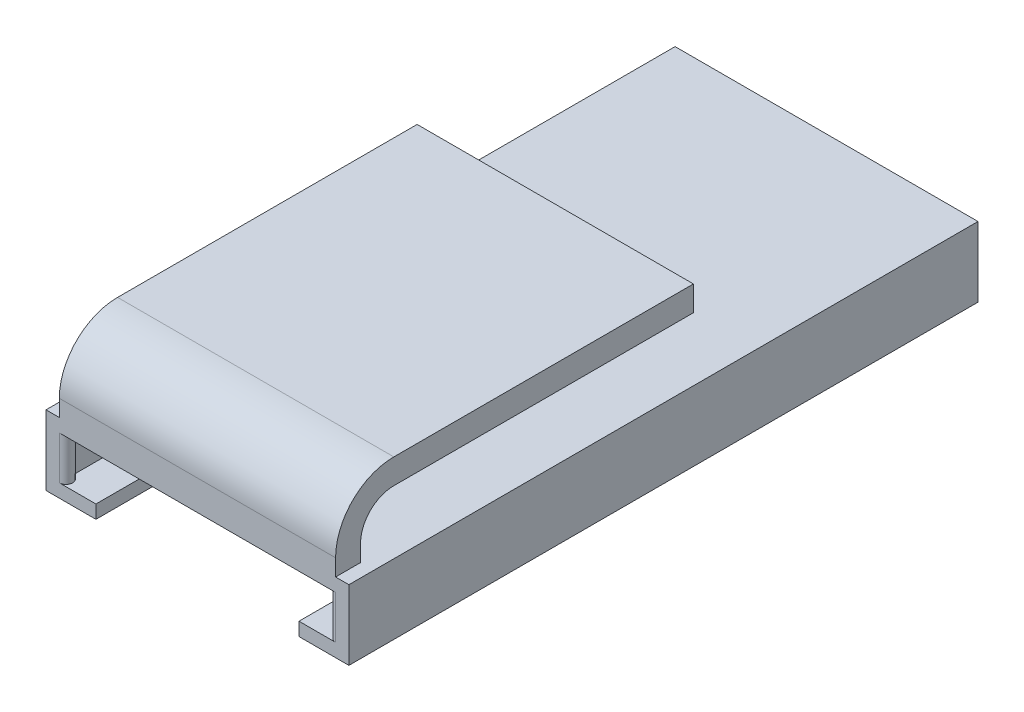
ISO-10303-21;
HEADER;
FILE_DESCRIPTION(('STEP AP214'),'2;1');
FILE_NAME('part.step','',(''),(''),'','','');
FILE_SCHEMA(('AUTOMOTIVE_DESIGN { 1 0 10303 214 1 1 1 1 }'));
ENDSEC;
DATA;
#1=APPLICATION_CONTEXT('core data for automotive mechanical design processes');
#2=APPLICATION_PROTOCOL_DEFINITION('international standard','automotive_design',2000,#1);
#3=PRODUCT_CONTEXT('',#1,'mechanical');
#4=PRODUCT('Part','Part','',(#3));
#5=PRODUCT_RELATED_PRODUCT_CATEGORY('part','',(#4));
#6=PRODUCT_DEFINITION_FORMATION('','',#4);
#7=PRODUCT_DEFINITION_CONTEXT('part definition',#1,'design');
#8=PRODUCT_DEFINITION('design','',#6,#7);
#9=PRODUCT_DEFINITION_SHAPE('','',#8);
#10=(LENGTH_UNIT() NAMED_UNIT(*) SI_UNIT(.MILLI.,.METRE.));
#11=(NAMED_UNIT(*) PLANE_ANGLE_UNIT() SI_UNIT($,.RADIAN.));
#12=(NAMED_UNIT(*) SI_UNIT($,.STERADIAN.) SOLID_ANGLE_UNIT());
#13=UNCERTAINTY_MEASURE_WITH_UNIT(LENGTH_MEASURE(1.E-05),#10,'distance_accuracy_value','');
#14=(GEOMETRIC_REPRESENTATION_CONTEXT(3) GLOBAL_UNCERTAINTY_ASSIGNED_CONTEXT((#13)) GLOBAL_UNIT_ASSIGNED_CONTEXT((#10,
#11,#12)) REPRESENTATION_CONTEXT('',''));
#15=CARTESIAN_POINT('',(0.,0.,0.));
#16=DIRECTION('',(0.,0.,1.));
#17=DIRECTION('',(1.,0.,0.));
#18=AXIS2_PLACEMENT_3D('',#15,#16,#17);
#19=CARTESIAN_POINT('',(0.,6.8,0.));
#20=DIRECTION('',(0.,-1.,0.));
#21=DIRECTION('',(0.,0.,-1.));
#22=AXIS2_PLACEMENT_3D('',#19,#20,#21);
#23=PLANE('',#22);
#24=DIRECTION('',(0.,0.,-1.));
#25=VECTOR('',#24,1.);
#26=CARTESIAN_POINT('',(33.2,6.8,-1.4));
#27=LINE('',#26,#25);
#28=CARTESIAN_POINT('',(33.2,6.8,1.6));
#29=VERTEX_POINT('',#28);
#30=CARTESIAN_POINT('',(33.2,6.8,-1.4));
#31=VERTEX_POINT('',#30);
#32=EDGE_CURVE('E234',#29,#31,#27,.T.);
#33=ORIENTED_EDGE('',*,*,#32,.F.);
#34=DIRECTION('',(1.,0.,0.));
#35=VECTOR('',#34,1.);
#36=CARTESIAN_POINT('',(-1.6,6.8,1.6));
#37=LINE('',#36,#35);
#38=CARTESIAN_POINT('',(34.8,6.8,1.6));
#39=VERTEX_POINT('',#38);
#40=EDGE_CURVE('E338',#29,#39,#37,.T.);
#41=ORIENTED_EDGE('',*,*,#40,.T.);
#42=DIRECTION('',(0.,0.,-1.));
#43=VECTOR('',#42,1.);
#44=CARTESIAN_POINT('',(34.8,6.8,1.6));
#45=LINE('',#44,#43);
#46=CARTESIAN_POINT('',(34.8,6.8,-74.));
#47=VERTEX_POINT('',#46);
#48=EDGE_CURVE('E343',#39,#47,#45,.T.);
#49=ORIENTED_EDGE('',*,*,#48,.T.);
#50=DIRECTION('',(-1.,0.,0.));
#51=VECTOR('',#50,1.);
#52=CARTESIAN_POINT('',(-1.6,6.8,-74.));
#53=LINE('',#52,#51);
#54=CARTESIAN_POINT('',(-1.6,6.8,-74.));
#55=VERTEX_POINT('',#54);
#56=EDGE_CURVE('E347',#47,#55,#53,.T.);
#57=ORIENTED_EDGE('',*,*,#56,.T.);
#58=DIRECTION('',(0.,0.,1.));
#59=VECTOR('',#58,1.);
#60=CARTESIAN_POINT('',(-1.6,6.8,1.6));
#61=LINE('',#60,#59);
#62=CARTESIAN_POINT('',(-1.6,6.8,1.6));
#63=VERTEX_POINT('',#62);
#64=EDGE_CURVE('E331',#55,#63,#61,.T.);
#65=ORIENTED_EDGE('',*,*,#64,.T.);
#66=CARTESIAN_POINT('',(0.,6.8,1.6));
#67=VERTEX_POINT('',#66);
#68=EDGE_CURVE('E339',#63,#67,#37,.T.);
#69=ORIENTED_EDGE('',*,*,#68,.T.);
#70=DIRECTION('',(0.,0.,-1.));
#71=VECTOR('',#70,1.);
#72=CARTESIAN_POINT('',(0.,6.8,-1.4));
#73=LINE('',#72,#71);
#74=CARTESIAN_POINT('',(0.,6.8,-1.4));
#75=VERTEX_POINT('',#74);
#76=EDGE_CURVE('E235',#67,#75,#73,.T.);
#77=ORIENTED_EDGE('',*,*,#76,.T.);
#78=DIRECTION('',(1.,0.,0.));
#79=VECTOR('',#78,1.);
#80=CARTESIAN_POINT('',(0.,6.8,-1.4));
#81=LINE('',#80,#79);
#82=EDGE_CURVE('E263',#75,#31,#81,.T.);
#83=ORIENTED_EDGE('',*,*,#82,.T.);
#84=EDGE_LOOP('',(#33,#41,#49,#57,#65,#69,#77,#83));
#85=FACE_BOUND('',#84,.T.);
#86=ADVANCED_FACE('F39',(#85),#23,.F.);
#87=CARTESIAN_POINT('',(0.,0.,0.));
#88=DIRECTION('',(0.,-1.,0.));
#89=DIRECTION('',(0.,0.,-1.));
#90=AXIS2_PLACEMENT_3D('',#87,#88,#89);
#91=PLANE('',#90);
#92=DIRECTION('',(1.,0.,0.));
#93=VECTOR('',#92,1.);
#94=CARTESIAN_POINT('',(0.,0.,1.6));
#95=LINE('',#94,#93);
#96=CARTESIAN_POINT('',(0.,0.,1.6));
#97=VERTEX_POINT('',#96);
#98=CARTESIAN_POINT('',(4.4,0.,1.6));
#99=VERTEX_POINT('',#98);
#100=EDGE_CURVE('E309',#97,#99,#95,.T.);
#101=ORIENTED_EDGE('',*,*,#100,.T.);
#102=DIRECTION('',(0.,0.,-1.));
#103=VECTOR('',#102,1.);
#104=CARTESIAN_POINT('',(4.4,0.,0.));
#105=LINE('',#104,#103);
#106=CARTESIAN_POINT('',(4.4,0.,-8.4));
#107=VERTEX_POINT('',#106);
#108=EDGE_CURVE('E230',#99,#107,#105,.T.);
#109=ORIENTED_EDGE('',*,*,#108,.T.);
#110=CARTESIAN_POINT('',(16.6,0.,-8.4));
#111=DIRECTION('',(0.,-1.,0.));
#112=DIRECTION('',(0.,0.,-1.));
#113=AXIS2_PLACEMENT_3D('',#110,#111,#112);
#114=CIRCLE('',#113,12.2);
#115=CARTESIAN_POINT('',(28.8,0.,-8.4));
#116=VERTEX_POINT('',#115);
#117=EDGE_CURVE('E223',#107,#116,#114,.T.);
#118=ORIENTED_EDGE('',*,*,#117,.T.);
#119=DIRECTION('',(0.,0.,1.));
#120=VECTOR('',#119,1.);
#121=CARTESIAN_POINT('',(28.8,0.,0.));
#122=LINE('',#121,#120);
#123=CARTESIAN_POINT('',(28.8,0.,1.6));
#124=VERTEX_POINT('',#123);
#125=EDGE_CURVE('E193',#116,#124,#122,.T.);
#126=ORIENTED_EDGE('',*,*,#125,.T.);
#127=CARTESIAN_POINT('',(33.2,0.,1.6));
#128=VERTEX_POINT('',#127);
#129=EDGE_CURVE('E307',#124,#128,#95,.T.);
#130=ORIENTED_EDGE('',*,*,#129,.T.);
#131=CARTESIAN_POINT('',(33.2,0.,0.8));
#132=DIRECTION('',(0.,-1.,0.));
#133=DIRECTION('',(0.,0.,1.));
#134=AXIS2_PLACEMENT_3D('',#131,#132,#133);
#135=CIRCLE('',#134,0.8);
#136=CARTESIAN_POINT('',(33.2,0.,0.));
#137=VERTEX_POINT('',#136);
#138=EDGE_CURVE('E313',#128,#137,#135,.T.);
#139=ORIENTED_EDGE('',*,*,#138,.T.);
#140=DIRECTION('',(0.,0.,-1.));
#141=VECTOR('',#140,1.);
#142=CARTESIAN_POINT('',(33.2,0.,0.));
#143=LINE('',#142,#141);
#144=CARTESIAN_POINT('',(33.2,0.,-72.4));
#145=VERTEX_POINT('',#144);
#146=EDGE_CURVE('E385',#137,#145,#143,.T.);
#147=ORIENTED_EDGE('',*,*,#146,.T.);
#148=DIRECTION('',(-1.,0.,0.));
#149=VECTOR('',#148,1.);
#150=CARTESIAN_POINT('',(0.,0.,-72.4));
#151=LINE('',#150,#149);
#152=CARTESIAN_POINT('',(0.,0.,-72.4));
#153=VERTEX_POINT('',#152);
#154=EDGE_CURVE('E373',#145,#153,#151,.T.);
#155=ORIENTED_EDGE('',*,*,#154,.T.);
#156=DIRECTION('',(0.,0.,1.));
#157=VECTOR('',#156,1.);
#158=CARTESIAN_POINT('',(0.,0.,0.));
#159=LINE('',#158,#157);
#160=CARTESIAN_POINT('',(0.,0.,0.));
#161=VERTEX_POINT('',#160);
#162=EDGE_CURVE('E367',#153,#161,#159,.T.);
#163=ORIENTED_EDGE('',*,*,#162,.T.);
#164=CARTESIAN_POINT('',(0.,0.,0.8));
#165=DIRECTION('',(0.,-1.,0.));
#166=DIRECTION('',(0.,0.,-1.));
#167=AXIS2_PLACEMENT_3D('',#164,#165,#166);
#168=CIRCLE('',#167,0.8);
#169=EDGE_CURVE('E303',#161,#97,#168,.T.);
#170=ORIENTED_EDGE('',*,*,#169,.T.);
#171=EDGE_LOOP('',(#101,#109,#118,#126,#130,#139,#147,#155,#163,#170));
#172=FACE_BOUND('',#171,.T.);
#173=ADVANCED_FACE('F429',(#172),#91,.F.);
#174=CARTESIAN_POINT('',(33.2,5.2,0.));
#175=DIRECTION('',(-1.,0.,0.));
#176=DIRECTION('',(0.,0.,1.));
#177=AXIS2_PLACEMENT_3D('',#174,#175,#176);
#178=PLANE('',#177);
#179=ORIENTED_EDGE('',*,*,#146,.F.);
#180=DIRECTION('',(0.,-1.,0.));
#181=VECTOR('',#180,1.);
#182=CARTESIAN_POINT('',(33.2,5.2,0.));
#183=LINE('',#182,#181);
#184=CARTESIAN_POINT('',(33.2,5.2,0.));
#185=VERTEX_POINT('',#184);
#186=EDGE_CURVE('E397',#185,#137,#183,.T.);
#187=ORIENTED_EDGE('',*,*,#186,.F.);
#188=DIRECTION('',(0.,0.,-1.));
#189=VECTOR('',#188,1.);
#190=CARTESIAN_POINT('',(33.2,5.2,0.));
#191=LINE('',#190,#189);
#192=CARTESIAN_POINT('',(33.2,5.2,-72.4));
#193=VERTEX_POINT('',#192);
#194=EDGE_CURVE('E372',#185,#193,#191,.T.);
#195=ORIENTED_EDGE('',*,*,#194,.T.);
#196=DIRECTION('',(0.,-1.,0.));
#197=VECTOR('',#196,1.);
#198=CARTESIAN_POINT('',(33.2,5.2,-72.4));
#199=LINE('',#198,#197);
#200=EDGE_CURVE('E394',#193,#145,#199,.T.);
#201=ORIENTED_EDGE('',*,*,#200,.T.);
#202=EDGE_LOOP('',(#179,#187,#195,#201));
#203=FACE_BOUND('',#202,.T.);
#204=ADVANCED_FACE('F452',(#203),#178,.T.);
#205=CARTESIAN_POINT('',(0.,5.2,-72.4));
#206=DIRECTION('',(0.,0.,1.));
#207=DIRECTION('',(1.,0.,0.));
#208=AXIS2_PLACEMENT_3D('',#205,#206,#207);
#209=PLANE('',#208);
#210=ORIENTED_EDGE('',*,*,#154,.F.);
#211=ORIENTED_EDGE('',*,*,#200,.F.);
#212=DIRECTION('',(-1.,0.,0.));
#213=VECTOR('',#212,1.);
#214=CARTESIAN_POINT('',(0.,5.2,-72.4));
#215=LINE('',#214,#213);
#216=CARTESIAN_POINT('',(0.,5.2,-72.4));
#217=VERTEX_POINT('',#216);
#218=EDGE_CURVE('E377',#193,#217,#215,.T.);
#219=ORIENTED_EDGE('',*,*,#218,.T.);
#220=DIRECTION('',(0.,-1.,0.));
#221=VECTOR('',#220,1.);
#222=CARTESIAN_POINT('',(0.,5.2,-72.4));
#223=LINE('',#222,#221);
#224=EDGE_CURVE('E381',#217,#153,#223,.T.);
#225=ORIENTED_EDGE('',*,*,#224,.T.);
#226=EDGE_LOOP('',(#210,#211,#219,#225));
#227=FACE_BOUND('',#226,.T.);
#228=ADVANCED_FACE('F450',(#227),#209,.T.);
#229=CARTESIAN_POINT('',(0.,5.2,0.));
#230=DIRECTION('',(1.,0.,0.));
#231=DIRECTION('',(0.,0.,-1.));
#232=AXIS2_PLACEMENT_3D('',#229,#230,#231);
#233=PLANE('',#232);
#234=ORIENTED_EDGE('',*,*,#162,.F.);
#235=ORIENTED_EDGE('',*,*,#224,.F.);
#236=DIRECTION('',(0.,0.,1.));
#237=VECTOR('',#236,1.);
#238=CARTESIAN_POINT('',(0.,5.2,0.));
#239=LINE('',#238,#237);
#240=CARTESIAN_POINT('',(0.,5.2,0.));
#241=VERTEX_POINT('',#240);
#242=EDGE_CURVE('E368',#217,#241,#239,.T.);
#243=ORIENTED_EDGE('',*,*,#242,.T.);
#244=DIRECTION('',(0.,-1.,0.));
#245=VECTOR('',#244,1.);
#246=CARTESIAN_POINT('',(0.,5.2,0.));
#247=LINE('',#246,#245);
#248=EDGE_CURVE('E400',#241,#161,#247,.T.);
#249=ORIENTED_EDGE('',*,*,#248,.T.);
#250=EDGE_LOOP('',(#234,#235,#243,#249));
#251=FACE_BOUND('',#250,.T.);
#252=ADVANCED_FACE('F446',(#251),#233,.T.);
#253=CARTESIAN_POINT('',(0.,5.2,0.));
#254=DIRECTION('',(0.,-1.,0.));
#255=DIRECTION('',(0.,0.,-1.));
#256=AXIS2_PLACEMENT_3D('',#253,#254,#255);
#257=PLANE('',#256);
#258=ORIENTED_EDGE('',*,*,#194,.F.);
#259=CARTESIAN_POINT('',(33.2,5.2,0.8));
#260=DIRECTION('',(0.,-1.,0.));
#261=DIRECTION('',(0.,0.,1.));
#262=AXIS2_PLACEMENT_3D('',#259,#260,#261);
#263=CIRCLE('',#262,0.8);
#264=CARTESIAN_POINT('',(33.2,5.2,1.6));
#265=VERTEX_POINT('',#264);
#266=EDGE_CURVE('E308',#265,#185,#263,.T.);
#267=ORIENTED_EDGE('',*,*,#266,.F.);
#268=DIRECTION('',(1.,0.,0.));
#269=VECTOR('',#268,1.);
#270=CARTESIAN_POINT('',(0.,5.2,1.6));
#271=LINE('',#270,#269);
#272=CARTESIAN_POINT('',(0.,5.2,1.6));
#273=VERTEX_POINT('',#272);
#274=EDGE_CURVE('E321',#273,#265,#271,.T.);
#275=ORIENTED_EDGE('',*,*,#274,.F.);
#276=CARTESIAN_POINT('',(0.,5.2,0.8));
#277=DIRECTION('',(0.,-1.,0.));
#278=DIRECTION('',(0.,0.,-1.));
#279=AXIS2_PLACEMENT_3D('',#276,#277,#278);
#280=CIRCLE('',#279,0.8);
#281=EDGE_CURVE('E290',#241,#273,#280,.T.);
#282=ORIENTED_EDGE('',*,*,#281,.F.);
#283=ORIENTED_EDGE('',*,*,#242,.F.);
#284=ORIENTED_EDGE('',*,*,#218,.F.);
#285=EDGE_LOOP('',(#258,#267,#275,#282,#283,#284));
#286=FACE_BOUND('',#285,.T.);
#287=ADVANCED_FACE('F439',(#286),#257,.T.);
#288=CARTESIAN_POINT('',(0.,0.,0.8));
#289=DIRECTION('',(0.,1.,0.));
#290=DIRECTION('',(0.,0.,1.));
#291=AXIS2_PLACEMENT_3D('',#288,#289,#290);
#292=CYLINDRICAL_SURFACE('',#291,0.8);
#293=ORIENTED_EDGE('',*,*,#281,.T.);
#294=DIRECTION('',(0.,1.,0.));
#295=VECTOR('',#294,1.);
#296=CARTESIAN_POINT('',(0.,0.,1.6));
#297=LINE('',#296,#295);
#298=EDGE_CURVE('E317',#97,#273,#297,.T.);
#299=ORIENTED_EDGE('',*,*,#298,.F.);
#300=ORIENTED_EDGE('',*,*,#169,.F.);
#301=ORIENTED_EDGE('',*,*,#248,.F.);
#302=EDGE_LOOP('',(#293,#299,#300,#301));
#303=FACE_BOUND('',#302,.T.);
#304=ADVANCED_FACE('F442',(#303),#292,.T.);
#305=CARTESIAN_POINT('',(33.2,0.,0.8));
#306=DIRECTION('',(0.,1.,0.));
#307=DIRECTION('',(0.,0.,1.));
#308=AXIS2_PLACEMENT_3D('',#305,#306,#307);
#309=CYLINDRICAL_SURFACE('',#308,0.8);
#310=ORIENTED_EDGE('',*,*,#266,.T.);
#311=ORIENTED_EDGE('',*,*,#186,.T.);
#312=ORIENTED_EDGE('',*,*,#138,.F.);
#313=DIRECTION('',(0.,1.,0.));
#314=VECTOR('',#313,1.);
#315=CARTESIAN_POINT('',(33.2,0.,1.6));
#316=LINE('',#315,#314);
#317=EDGE_CURVE('E327',#128,#265,#316,.T.);
#318=ORIENTED_EDGE('',*,*,#317,.T.);
#319=EDGE_LOOP('',(#310,#311,#312,#318));
#320=FACE_BOUND('',#319,.T.);
#321=ADVANCED_FACE('F433',(#320),#309,.T.);
#322=CARTESIAN_POINT('',(-1.6,5.2,1.6));
#323=DIRECTION('',(0.,0.,-1.));
#324=DIRECTION('',(-1.,0.,0.));
#325=AXIS2_PLACEMENT_3D('',#322,#323,#324);
#326=PLANE('',#325);
#327=DIRECTION('',(0.,-1.,0.));
#328=VECTOR('',#327,1.);
#329=CARTESIAN_POINT('',(33.2,15.8,1.6));
#330=LINE('',#329,#328);
#331=CARTESIAN_POINT('',(33.2,8.8,1.6));
#332=VERTEX_POINT('',#331);
#333=EDGE_CURVE('E240',#332,#29,#330,.T.);
#334=ORIENTED_EDGE('',*,*,#333,.F.);
#335=DIRECTION('',(1.,0.,0.));
#336=VECTOR('',#335,1.);
#337=CARTESIAN_POINT('',(0.,8.8,1.6));
#338=LINE('',#337,#336);
#339=CARTESIAN_POINT('',(0.,8.8,1.6));
#340=VERTEX_POINT('',#339);
#341=EDGE_CURVE('E48',#332,#340,#338,.F.);
#342=ORIENTED_EDGE('',*,*,#341,.T.);
#343=DIRECTION('',(0.,-1.,0.));
#344=VECTOR('',#343,1.);
#345=CARTESIAN_POINT('',(0.,15.8,1.6));
#346=LINE('',#345,#344);
#347=EDGE_CURVE('E260',#340,#67,#346,.T.);
#348=ORIENTED_EDGE('',*,*,#347,.T.);
#349=ORIENTED_EDGE('',*,*,#68,.F.);
#350=DIRECTION('',(0.,-1.,0.));
#351=VECTOR('',#350,1.);
#352=CARTESIAN_POINT('',(-1.6,5.2,1.6));
#353=LINE('',#352,#351);
#354=CARTESIAN_POINT('',(-1.6,-1.6,1.6));
#355=VERTEX_POINT('',#354);
#356=EDGE_CURVE('E404',#63,#355,#353,.T.);
#357=ORIENTED_EDGE('',*,*,#356,.T.);
#358=DIRECTION('',(1.,0.,0.));
#359=VECTOR('',#358,1.);
#360=CARTESIAN_POINT('',(-1.6,-1.6,1.6));
#361=LINE('',#360,#359);
#362=CARTESIAN_POINT('',(4.4,-1.6,1.6));
#363=VERTEX_POINT('',#362);
#364=EDGE_CURVE('E355',#355,#363,#361,.T.);
#365=ORIENTED_EDGE('',*,*,#364,.T.);
#366=DIRECTION('',(0.,-1.,0.));
#367=VECTOR('',#366,1.);
#368=CARTESIAN_POINT('',(4.4,0.4,1.6));
#369=LINE('',#368,#367);
#370=EDGE_CURVE('E220',#99,#363,#369,.T.);
#371=ORIENTED_EDGE('',*,*,#370,.F.);
#372=ORIENTED_EDGE('',*,*,#100,.F.);
#373=ORIENTED_EDGE('',*,*,#298,.T.);
#374=ORIENTED_EDGE('',*,*,#274,.T.);
#375=ORIENTED_EDGE('',*,*,#317,.F.);
#376=ORIENTED_EDGE('',*,*,#129,.F.);
#377=DIRECTION('',(0.,-1.,0.));
#378=VECTOR('',#377,1.);
#379=CARTESIAN_POINT('',(28.8,0.4,1.6));
#380=LINE('',#379,#378);
#381=CARTESIAN_POINT('',(28.8,-1.6,1.6));
#382=VERTEX_POINT('',#381);
#383=EDGE_CURVE('E197',#124,#382,#380,.T.);
#384=ORIENTED_EDGE('',*,*,#383,.T.);
#385=CARTESIAN_POINT('',(34.8,-1.6,1.6));
#386=VERTEX_POINT('',#385);
#387=EDGE_CURVE('E213',#382,#386,#361,.T.);
#388=ORIENTED_EDGE('',*,*,#387,.T.);
#389=DIRECTION('',(0.,-1.,0.));
#390=VECTOR('',#389,1.);
#391=CARTESIAN_POINT('',(34.8,5.2,1.6));
#392=LINE('',#391,#390);
#393=EDGE_CURVE('E413',#39,#386,#392,.T.);
#394=ORIENTED_EDGE('',*,*,#393,.F.);
#395=ORIENTED_EDGE('',*,*,#40,.F.);
#396=EDGE_LOOP('',(#334,#342,#348,#349,#357,#365,#371,#372,#373,#374,#375,#376,#384,#388,#394,#395));
#397=FACE_BOUND('',#396,.T.);
#398=ADVANCED_FACE('F435',(#397),#326,.F.);
#399=CARTESIAN_POINT('',(34.8,5.2,1.6));
#400=DIRECTION('',(-1.,0.,0.));
#401=DIRECTION('',(0.,0.,1.));
#402=AXIS2_PLACEMENT_3D('',#399,#400,#401);
#403=PLANE('',#402);
#404=ORIENTED_EDGE('',*,*,#393,.T.);
#405=DIRECTION('',(0.,0.,-1.));
#406=VECTOR('',#405,1.);
#407=CARTESIAN_POINT('',(34.8,-1.6,1.6));
#408=LINE('',#407,#406);
#409=CARTESIAN_POINT('',(34.8,-1.6,-74.));
#410=VERTEX_POINT('',#409);
#411=EDGE_CURVE('E359',#386,#410,#408,.T.);
#412=ORIENTED_EDGE('',*,*,#411,.T.);
#413=DIRECTION('',(0.,-1.,0.));
#414=VECTOR('',#413,1.);
#415=CARTESIAN_POINT('',(34.8,5.2,-74.));
#416=LINE('',#415,#414);
#417=EDGE_CURVE('E410',#47,#410,#416,.T.);
#418=ORIENTED_EDGE('',*,*,#417,.F.);
#419=ORIENTED_EDGE('',*,*,#48,.F.);
#420=EDGE_LOOP('',(#404,#412,#418,#419));
#421=FACE_BOUND('',#420,.T.);
#422=ADVANCED_FACE('F473',(#421),#403,.F.);
#423=CARTESIAN_POINT('',(-1.6,5.2,-74.));
#424=DIRECTION('',(0.,0.,1.));
#425=DIRECTION('',(1.,0.,0.));
#426=AXIS2_PLACEMENT_3D('',#423,#424,#425);
#427=PLANE('',#426);
#428=ORIENTED_EDGE('',*,*,#417,.T.);
#429=DIRECTION('',(-1.,0.,0.));
#430=VECTOR('',#429,1.);
#431=CARTESIAN_POINT('',(-1.6,-1.6,-74.));
#432=LINE('',#431,#430);
#433=CARTESIAN_POINT('',(-1.6,-1.6,-74.));
#434=VERTEX_POINT('',#433);
#435=EDGE_CURVE('E363',#410,#434,#432,.T.);
#436=ORIENTED_EDGE('',*,*,#435,.T.);
#437=DIRECTION('',(0.,-1.,0.));
#438=VECTOR('',#437,1.);
#439=CARTESIAN_POINT('',(-1.6,5.2,-74.));
#440=LINE('',#439,#438);
#441=EDGE_CURVE('E407',#55,#434,#440,.T.);
#442=ORIENTED_EDGE('',*,*,#441,.F.);
#443=ORIENTED_EDGE('',*,*,#56,.F.);
#444=EDGE_LOOP('',(#428,#436,#442,#443));
#445=FACE_BOUND('',#444,.T.);
#446=ADVANCED_FACE('F466',(#445),#427,.F.);
#447=CARTESIAN_POINT('',(-1.6,5.2,1.6));
#448=DIRECTION('',(1.,0.,0.));
#449=DIRECTION('',(0.,0.,-1.));
#450=AXIS2_PLACEMENT_3D('',#447,#448,#449);
#451=PLANE('',#450);
#452=ORIENTED_EDGE('',*,*,#441,.T.);
#453=DIRECTION('',(0.,0.,1.));
#454=VECTOR('',#453,1.);
#455=CARTESIAN_POINT('',(-1.6,-1.6,1.6));
#456=LINE('',#455,#454);
#457=EDGE_CURVE('E351',#434,#355,#456,.T.);
#458=ORIENTED_EDGE('',*,*,#457,.T.);
#459=ORIENTED_EDGE('',*,*,#356,.F.);
#460=ORIENTED_EDGE('',*,*,#64,.F.);
#461=EDGE_LOOP('',(#452,#458,#459,#460));
#462=FACE_BOUND('',#461,.T.);
#463=ADVANCED_FACE('F461',(#462),#451,.F.);
#464=CARTESIAN_POINT('',(0.,-1.6,0.));
#465=DIRECTION('',(0.,-1.,0.));
#466=DIRECTION('',(0.,0.,-1.));
#467=AXIS2_PLACEMENT_3D('',#464,#465,#466);
#468=PLANE('',#467);
#469=DIRECTION('',(0.,0.,-1.));
#470=VECTOR('',#469,1.);
#471=CARTESIAN_POINT('',(4.4,-1.6,-8.4));
#472=LINE('',#471,#470);
#473=CARTESIAN_POINT('',(4.4,-1.6,-8.4));
#474=VERTEX_POINT('',#473);
#475=EDGE_CURVE('E208',#363,#474,#472,.T.);
#476=ORIENTED_EDGE('',*,*,#475,.F.);
#477=ORIENTED_EDGE('',*,*,#364,.F.);
#478=ORIENTED_EDGE('',*,*,#457,.F.);
#479=ORIENTED_EDGE('',*,*,#435,.F.);
#480=ORIENTED_EDGE('',*,*,#411,.F.);
#481=ORIENTED_EDGE('',*,*,#387,.F.);
#482=DIRECTION('',(0.,0.,1.));
#483=VECTOR('',#482,1.);
#484=CARTESIAN_POINT('',(28.8,-1.6,1.6));
#485=LINE('',#484,#483);
#486=CARTESIAN_POINT('',(28.8,-1.6,-8.4));
#487=VERTEX_POINT('',#486);
#488=EDGE_CURVE('E190',#487,#382,#485,.T.);
#489=ORIENTED_EDGE('',*,*,#488,.F.);
#490=CARTESIAN_POINT('',(16.6,-1.6,-8.4));
#491=DIRECTION('',(0.,-1.,0.));
#492=DIRECTION('',(0.,0.,-1.));
#493=AXIS2_PLACEMENT_3D('',#490,#491,#492);
#494=CIRCLE('',#493,12.2);
#495=EDGE_CURVE('E202',#474,#487,#494,.T.);
#496=ORIENTED_EDGE('',*,*,#495,.F.);
#497=EDGE_LOOP('',(#476,#477,#478,#479,#480,#481,#489,#496));
#498=FACE_BOUND('',#497,.T.);
#499=ADVANCED_FACE('F211',(#498),#468,.T.);
#500=CARTESIAN_POINT('',(0.,15.8,-41.4));
#501=DIRECTION('',(0.,1.,0.));
#502=DIRECTION('',(0.,0.,1.));
#503=AXIS2_PLACEMENT_3D('',#500,#501,#502);
#504=PLANE('',#503);
#505=DIRECTION('',(0.,0.,1.));
#506=VECTOR('',#505,1.);
#507=CARTESIAN_POINT('',(0.,15.8,-41.4));
#508=LINE('',#507,#506);
#509=CARTESIAN_POINT('',(0.,15.8,-41.4));
#510=VERTEX_POINT('',#509);
#511=CARTESIAN_POINT('',(0.,15.8,-5.4));
#512=VERTEX_POINT('',#511);
#513=EDGE_CURVE('E256',#510,#512,#508,.T.);
#514=ORIENTED_EDGE('',*,*,#513,.T.);
#515=DIRECTION('',(1.,0.,0.));
#516=VECTOR('',#515,1.);
#517=CARTESIAN_POINT('',(33.2,15.8,-5.4));
#518=LINE('',#517,#516);
#519=CARTESIAN_POINT('',(33.2,15.8,-5.4));
#520=VERTEX_POINT('',#519);
#521=EDGE_CURVE('E417',#512,#520,#518,.T.);
#522=ORIENTED_EDGE('',*,*,#521,.T.);
#523=DIRECTION('',(0.,0.,1.));
#524=VECTOR('',#523,1.);
#525=CARTESIAN_POINT('',(33.2,15.8,-41.4));
#526=LINE('',#525,#524);
#527=CARTESIAN_POINT('',(33.2,15.8,-41.4));
#528=VERTEX_POINT('',#527);
#529=EDGE_CURVE('E282',#528,#520,#526,.T.);
#530=ORIENTED_EDGE('',*,*,#529,.F.);
#531=DIRECTION('',(1.,0.,0.));
#532=VECTOR('',#531,1.);
#533=CARTESIAN_POINT('',(0.,15.8,-41.4));
#534=LINE('',#533,#532);
#535=EDGE_CURVE('E287',#510,#528,#534,.T.);
#536=ORIENTED_EDGE('',*,*,#535,.F.);
#537=EDGE_LOOP('',(#514,#522,#530,#536));
#538=FACE_BOUND('',#537,.T.);
#539=ADVANCED_FACE('F483',(#538),#504,.T.);
#540=CARTESIAN_POINT('',(0.,12.8,-41.4));
#541=DIRECTION('',(0.,0.,-1.));
#542=DIRECTION('',(-1.,0.,0.));
#543=AXIS2_PLACEMENT_3D('',#540,#541,#542);
#544=PLANE('',#543);
#545=DIRECTION('',(0.,1.,0.));
#546=VECTOR('',#545,1.);
#547=CARTESIAN_POINT('',(33.2,12.8,-41.4));
#548=LINE('',#547,#546);
#549=CARTESIAN_POINT('',(33.2,12.8,-41.4));
#550=VERTEX_POINT('',#549);
#551=EDGE_CURVE('E278',#550,#528,#548,.T.);
#552=ORIENTED_EDGE('',*,*,#551,.F.);
#553=DIRECTION('',(1.,0.,0.));
#554=VECTOR('',#553,1.);
#555=CARTESIAN_POINT('',(0.,12.8,-41.4));
#556=LINE('',#555,#554);
#557=CARTESIAN_POINT('',(0.,12.8,-41.4));
#558=VERTEX_POINT('',#557);
#559=EDGE_CURVE('E291',#558,#550,#556,.T.);
#560=ORIENTED_EDGE('',*,*,#559,.F.);
#561=DIRECTION('',(0.,1.,0.));
#562=VECTOR('',#561,1.);
#563=CARTESIAN_POINT('',(0.,12.8,-41.4));
#564=LINE('',#563,#562);
#565=EDGE_CURVE('E252',#558,#510,#564,.T.);
#566=ORIENTED_EDGE('',*,*,#565,.T.);
#567=ORIENTED_EDGE('',*,*,#535,.T.);
#568=EDGE_LOOP('',(#552,#560,#566,#567));
#569=FACE_BOUND('',#568,.T.);
#570=ADVANCED_FACE('F487',(#569),#544,.T.);
#571=CARTESIAN_POINT('',(0.,12.8,-5.40000000000003));
#572=DIRECTION('',(0.,-1.,0.));
#573=DIRECTION('',(0.,0.,-1.));
#574=AXIS2_PLACEMENT_3D('',#571,#572,#573);
#575=PLANE('',#574);
#576=DIRECTION('',(0.,0.,-1.));
#577=VECTOR('',#576,1.);
#578=CARTESIAN_POINT('',(33.2,12.8,-5.40000000000003));
#579=LINE('',#578,#577);
#580=CARTESIAN_POINT('',(33.2,12.8,-5.40000000000003));
#581=VERTEX_POINT('',#580);
#582=EDGE_CURVE('E274',#581,#550,#579,.T.);
#583=ORIENTED_EDGE('',*,*,#582,.F.);
#584=DIRECTION('',(1.,0.,0.));
#585=VECTOR('',#584,1.);
#586=CARTESIAN_POINT('',(0.,12.8,-5.40000000000003));
#587=LINE('',#586,#585);
#588=CARTESIAN_POINT('',(0.,12.8,-5.40000000000003));
#589=VERTEX_POINT('',#588);
#590=EDGE_CURVE('E294',#589,#581,#587,.T.);
#591=ORIENTED_EDGE('',*,*,#590,.F.);
#592=DIRECTION('',(0.,0.,-1.));
#593=VECTOR('',#592,1.);
#594=CARTESIAN_POINT('',(0.,12.8,-5.40000000000003));
#595=LINE('',#594,#593);
#596=EDGE_CURVE('E248',#589,#558,#595,.T.);
#597=ORIENTED_EDGE('',*,*,#596,.T.);
#598=ORIENTED_EDGE('',*,*,#559,.T.);
#599=EDGE_LOOP('',(#583,#591,#597,#598));
#600=FACE_BOUND('',#599,.T.);
#601=ADVANCED_FACE('F492',(#600),#575,.T.);
#602=CARTESIAN_POINT('',(0.,8.8,-5.4));
#603=DIRECTION('',(1.,0.,0.));
#604=DIRECTION('',(0.,0.,-1.));
#605=AXIS2_PLACEMENT_3D('',#602,#603,#604);
#606=CYLINDRICAL_SURFACE('',#605,4.);
#607=CARTESIAN_POINT('',(33.2,8.8,-5.4));
#608=DIRECTION('',(-1.,0.,0.));
#609=DIRECTION('',(0.,0.,1.));
#610=AXIS2_PLACEMENT_3D('',#607,#608,#609);
#611=CIRCLE('',#610,4.);
#612=CARTESIAN_POINT('',(33.2,8.79999999999997,-1.4));
#613=VERTEX_POINT('',#612);
#614=EDGE_CURVE('E270',#613,#581,#611,.T.);
#615=ORIENTED_EDGE('',*,*,#614,.F.);
#616=DIRECTION('',(1.,0.,0.));
#617=VECTOR('',#616,1.);
#618=CARTESIAN_POINT('',(0.,8.79999999999997,-1.4));
#619=LINE('',#618,#617);
#620=CARTESIAN_POINT('',(0.,8.79999999999997,-1.4));
#621=VERTEX_POINT('',#620);
#622=EDGE_CURVE('E297',#621,#613,#619,.T.);
#623=ORIENTED_EDGE('',*,*,#622,.F.);
#624=CARTESIAN_POINT('',(0.,8.8,-5.4));
#625=DIRECTION('',(-1.,0.,0.));
#626=DIRECTION('',(0.,0.,1.));
#627=AXIS2_PLACEMENT_3D('',#624,#625,#626);
#628=CIRCLE('',#627,4.);
#629=EDGE_CURVE('E244',#621,#589,#628,.T.);
#630=ORIENTED_EDGE('',*,*,#629,.T.);
#631=ORIENTED_EDGE('',*,*,#590,.T.);
#632=EDGE_LOOP('',(#615,#623,#630,#631));
#633=FACE_BOUND('',#632,.T.);
#634=ADVANCED_FACE('F495',(#633),#606,.F.);
#635=CARTESIAN_POINT('',(0.,6.8,-1.4));
#636=DIRECTION('',(0.,0.,-1.));
#637=DIRECTION('',(-1.,0.,0.));
#638=AXIS2_PLACEMENT_3D('',#635,#636,#637);
#639=PLANE('',#638);
#640=DIRECTION('',(0.,1.,0.));
#641=VECTOR('',#640,1.);
#642=CARTESIAN_POINT('',(33.2,6.8,-1.4));
#643=LINE('',#642,#641);
#644=EDGE_CURVE('E266',#31,#613,#643,.T.);
#645=ORIENTED_EDGE('',*,*,#644,.F.);
#646=ORIENTED_EDGE('',*,*,#82,.F.);
#647=DIRECTION('',(0.,1.,0.));
#648=VECTOR('',#647,1.);
#649=CARTESIAN_POINT('',(0.,6.8,-1.4));
#650=LINE('',#649,#648);
#651=EDGE_CURVE('E239',#75,#621,#650,.T.);
#652=ORIENTED_EDGE('',*,*,#651,.T.);
#653=ORIENTED_EDGE('',*,*,#622,.T.);
#654=EDGE_LOOP('',(#645,#646,#652,#653));
#655=FACE_BOUND('',#654,.T.);
#656=ADVANCED_FACE('F499',(#655),#639,.T.);
#657=CARTESIAN_POINT('',(0.,8.8,-5.4));
#658=DIRECTION('',(-1.,0.,0.));
#659=DIRECTION('',(0.,0.,1.));
#660=AXIS2_PLACEMENT_3D('',#657,#658,#659);
#661=PLANE('',#660);
#662=ORIENTED_EDGE('',*,*,#347,.F.);
#663=CARTESIAN_POINT('',(0.,8.8,-5.4));
#664=DIRECTION('',(-1.,0.,0.));
#665=DIRECTION('',(0.,0.,1.));
#666=AXIS2_PLACEMENT_3D('',#663,#664,#665);
#667=CIRCLE('',#666,7.);
#668=EDGE_CURVE('E11',#340,#512,#667,.T.);
#669=ORIENTED_EDGE('',*,*,#668,.T.);
#670=ORIENTED_EDGE('',*,*,#513,.F.);
#671=ORIENTED_EDGE('',*,*,#565,.F.);
#672=ORIENTED_EDGE('',*,*,#596,.F.);
#673=ORIENTED_EDGE('',*,*,#629,.F.);
#674=ORIENTED_EDGE('',*,*,#651,.F.);
#675=ORIENTED_EDGE('',*,*,#76,.F.);
#676=EDGE_LOOP('',(#662,#669,#670,#671,#672,#673,#674,#675));
#677=FACE_BOUND('',#676,.T.);
#678=ADVANCED_FACE('F479',(#677),#661,.T.);
#679=CARTESIAN_POINT('',(33.2,8.8,-5.4));
#680=DIRECTION('',(-1.,0.,0.));
#681=DIRECTION('',(0.,0.,1.));
#682=AXIS2_PLACEMENT_3D('',#679,#680,#681);
#683=PLANE('',#682);
#684=ORIENTED_EDGE('',*,*,#529,.T.);
#685=CARTESIAN_POINT('',(33.2,8.8,-5.4));
#686=DIRECTION('',(-1.,0.,0.));
#687=DIRECTION('',(0.,0.,1.));
#688=AXIS2_PLACEMENT_3D('',#685,#686,#687);
#689=CIRCLE('',#688,7.);
#690=EDGE_CURVE('E62',#520,#332,#689,.F.);
#691=ORIENTED_EDGE('',*,*,#690,.T.);
#692=ORIENTED_EDGE('',*,*,#333,.T.);
#693=ORIENTED_EDGE('',*,*,#32,.T.);
#694=ORIENTED_EDGE('',*,*,#644,.T.);
#695=ORIENTED_EDGE('',*,*,#614,.T.);
#696=ORIENTED_EDGE('',*,*,#582,.T.);
#697=ORIENTED_EDGE('',*,*,#551,.T.);
#698=EDGE_LOOP('',(#684,#691,#692,#693,#694,#695,#696,#697));
#699=FACE_BOUND('',#698,.T.);
#700=ADVANCED_FACE('F500',(#699),#683,.F.);
#701=CARTESIAN_POINT('',(4.4,0.4,-8.4));
#702=DIRECTION('',(-1.,0.,0.));
#703=DIRECTION('',(0.,0.,1.));
#704=AXIS2_PLACEMENT_3D('',#701,#702,#703);
#705=PLANE('',#704);
#706=ORIENTED_EDGE('',*,*,#370,.T.);
#707=ORIENTED_EDGE('',*,*,#475,.T.);
#708=DIRECTION('',(0.,-1.,0.));
#709=VECTOR('',#708,1.);
#710=CARTESIAN_POINT('',(4.4,0.4,-8.4));
#711=LINE('',#710,#709);
#712=EDGE_CURVE('E198',#107,#474,#711,.T.);
#713=ORIENTED_EDGE('',*,*,#712,.F.);
#714=ORIENTED_EDGE('',*,*,#108,.F.);
#715=EDGE_LOOP('',(#706,#707,#713,#714));
#716=FACE_BOUND('',#715,.T.);
#717=ADVANCED_FACE('F456',(#716),#705,.F.);
#718=CARTESIAN_POINT('',(28.8,0.4,1.6));
#719=DIRECTION('',(1.,0.,0.));
#720=DIRECTION('',(0.,0.,-1.));
#721=AXIS2_PLACEMENT_3D('',#718,#719,#720);
#722=PLANE('',#721);
#723=DIRECTION('',(0.,-1.,0.));
#724=VECTOR('',#723,1.);
#725=CARTESIAN_POINT('',(28.8,0.4,-8.4));
#726=LINE('',#725,#724);
#727=EDGE_CURVE('E186',#116,#487,#726,.T.);
#728=ORIENTED_EDGE('',*,*,#727,.T.);
#729=ORIENTED_EDGE('',*,*,#488,.T.);
#730=ORIENTED_EDGE('',*,*,#383,.F.);
#731=ORIENTED_EDGE('',*,*,#125,.F.);
#732=EDGE_LOOP('',(#728,#729,#730,#731));
#733=FACE_BOUND('',#732,.T.);
#734=ADVANCED_FACE('F188',(#733),#722,.F.);
#735=CARTESIAN_POINT('',(16.6,0.4,-8.4));
#736=DIRECTION('',(0.,-1.,0.));
#737=DIRECTION('',(0.,0.,-1.));
#738=AXIS2_PLACEMENT_3D('',#735,#736,#737);
#739=CYLINDRICAL_SURFACE('',#738,12.2);
#740=ORIENTED_EDGE('',*,*,#712,.T.);
#741=ORIENTED_EDGE('',*,*,#495,.T.);
#742=ORIENTED_EDGE('',*,*,#727,.F.);
#743=ORIENTED_EDGE('',*,*,#117,.F.);
#744=EDGE_LOOP('',(#740,#741,#742,#743));
#745=FACE_BOUND('',#744,.T.);
#746=ADVANCED_FACE('F203',(#745),#739,.F.);
#747=CARTESIAN_POINT('',(0.,8.8,-5.4));
#748=DIRECTION('',(-1.,0.,0.));
#749=DIRECTION('',(0.,0.,1.));
#750=AXIS2_PLACEMENT_3D('',#747,#748,#749);
#751=CYLINDRICAL_SURFACE('',#750,7.);
#752=ORIENTED_EDGE('',*,*,#668,.F.);
#753=ORIENTED_EDGE('',*,*,#341,.F.);
#754=ORIENTED_EDGE('',*,*,#690,.F.);
#755=ORIENTED_EDGE('',*,*,#521,.F.);
#756=EDGE_LOOP('',(#752,#753,#754,#755));
#757=FACE_BOUND('',#756,.T.);
#758=ADVANCED_FACE('F41',(#757),#751,.T.);
#759=CLOSED_SHELL('',(#86,#173,#204,#228,#252,#287,#304,#321,#398,#422,#446,#463,#499,#539,#570,
#601,#634,#656,#678,#700,#717,#734,#746,#758));
#760=MANIFOLD_SOLID_BREP('B2',#759);
#761=ADVANCED_BREP_SHAPE_REPRESENTATION('',(#18,#760),#14);
#762=SHAPE_DEFINITION_REPRESENTATION(#9,#761);
ENDSEC;
END-ISO-10303-21;
